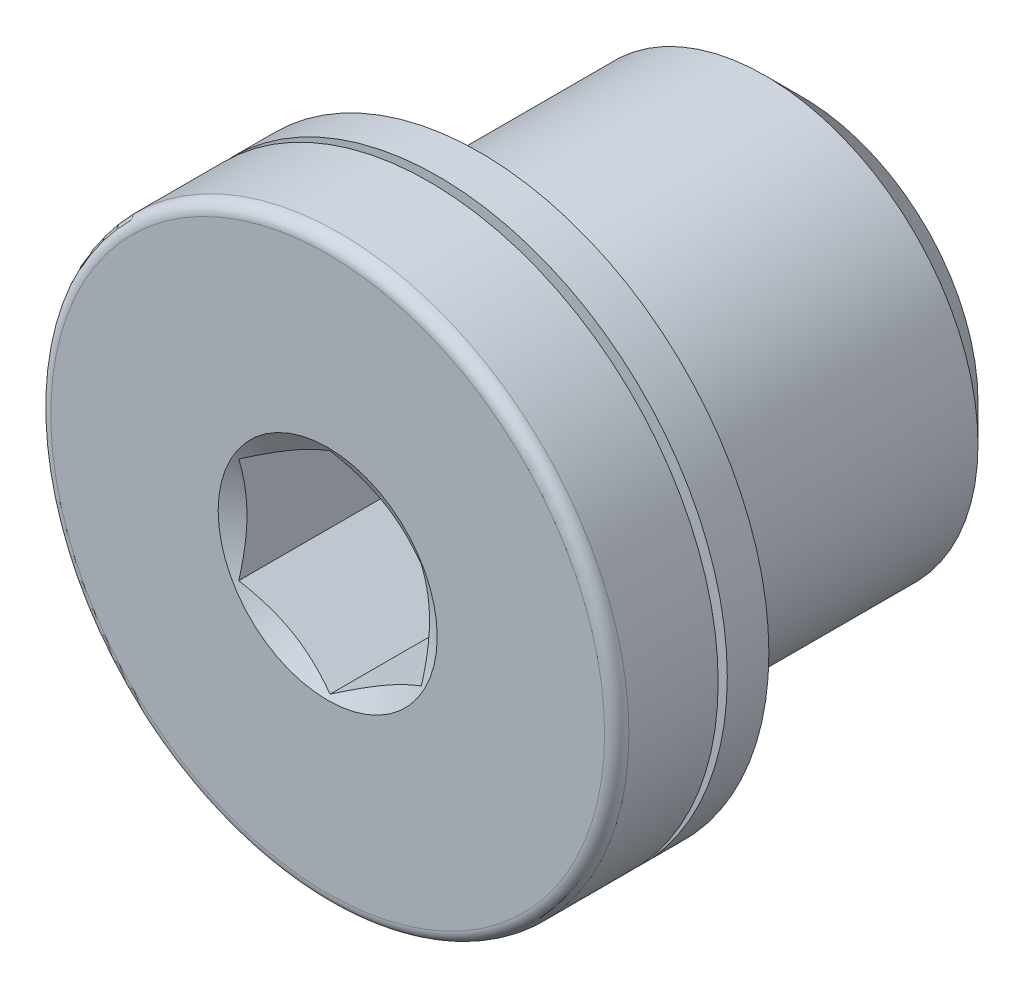
ISO-10303-21;
HEADER;
FILE_DESCRIPTION(('STEP AP214'),'2;1');
FILE_NAME('part.step','',(''),(''),'','','');
FILE_SCHEMA(('AUTOMOTIVE_DESIGN { 1 0 10303 214 1 1 1 1 }'));
ENDSEC;
DATA;
#1=APPLICATION_CONTEXT('core data for automotive mechanical design processes');
#2=APPLICATION_PROTOCOL_DEFINITION('international standard','automotive_design',2000,#1);
#3=PRODUCT_CONTEXT('',#1,'mechanical');
#4=PRODUCT('Part','Part','',(#3));
#5=PRODUCT_RELATED_PRODUCT_CATEGORY('part','',(#4));
#6=PRODUCT_DEFINITION_FORMATION('','',#4);
#7=PRODUCT_DEFINITION_CONTEXT('part definition',#1,'design');
#8=PRODUCT_DEFINITION('design','',#6,#7);
#9=PRODUCT_DEFINITION_SHAPE('','',#8);
#10=(LENGTH_UNIT() NAMED_UNIT(*) SI_UNIT(.MILLI.,.METRE.));
#11=(NAMED_UNIT(*) PLANE_ANGLE_UNIT() SI_UNIT($,.RADIAN.));
#12=(NAMED_UNIT(*) SI_UNIT($,.STERADIAN.) SOLID_ANGLE_UNIT());
#13=UNCERTAINTY_MEASURE_WITH_UNIT(LENGTH_MEASURE(1.E-05),#10,'distance_accuracy_value','');
#14=(GEOMETRIC_REPRESENTATION_CONTEXT(3) GLOBAL_UNCERTAINTY_ASSIGNED_CONTEXT((#13)) GLOBAL_UNIT_ASSIGNED_CONTEXT((#10,
#11,#12)) REPRESENTATION_CONTEXT('',''));
#15=CARTESIAN_POINT('',(0.,0.,0.));
#16=DIRECTION('',(0.,0.,1.));
#17=DIRECTION('',(1.,0.,0.));
#18=AXIS2_PLACEMENT_3D('',#15,#16,#17);
#19=CARTESIAN_POINT('',(0.,0.,2.5));
#20=DIRECTION('',(0.,0.,1.));
#21=DIRECTION('',(1.,0.,0.));
#22=AXIS2_PLACEMENT_3D('',#19,#20,#21);
#23=CONICAL_SURFACE('',#22,1.8,1.04719755119661);
#24=CARTESIAN_POINT('',(0.0002,-1.73216627762274,2.46083618879158));
#25=CARTESIAN_POINT('',(-0.065719291102548,-1.69410775715989,2.4388523720123));
#26=CARTESIAN_POINT('',(-0.132207589122236,-1.65572072040026,2.41885840492495));
#27=CARTESIAN_POINT('',(-0.266335660665071,-1.57828184218912,2.38395761642763));
#28=CARTESIAN_POINT('',(-0.333977818646887,-1.53922862406975,2.36906314356629));
#29=CARTESIAN_POINT('',(-0.468423777869844,-1.46160621332092,2.34587619655337));
#30=CARTESIAN_POINT('',(-0.535206884927249,-1.423048968484,2.33742942695494));
#31=CARTESIAN_POINT('',(-0.669087568389883,-1.34575291984756,2.32734309275498));
#32=CARTESIAN_POINT('',(-0.736184657704381,-1.30701439726999,2.32569517860101));
#33=CARTESIAN_POINT('',(-0.861574731829198,-1.23462040422032,2.32911113829623));
#34=CARTESIAN_POINT('',(-0.919886423219822,-1.20095413349904,2.3333362744671));
#35=CARTESIAN_POINT('',(-1.03612987953878,-1.13384094270175,2.34673129067579));
#36=CARTESIAN_POINT('',(-1.09406124196879,-1.10039425500827,2.35590575285897));
#37=CARTESIAN_POINT('',(-1.21054465133915,-1.03314252725216,2.37884269919811));
#38=CARTESIAN_POINT('',(-1.26908194454669,-0.999346005261155,2.39270247740456));
#39=CARTESIAN_POINT('',(-1.38528312338636,-0.93225722337792,2.42415929947977));
#40=CARTESIAN_POINT('',(-1.44294849940381,-0.898964103011323,2.44174894513273));
#41=CARTESIAN_POINT('',(-1.5002,-0.865909933730602,2.46083618879156));
#42=B_SPLINE_CURVE_WITH_KNOTS('',3,(#24,#25,#26,#27,#28,#29,#30,#31,#32,#33,#34,#35,#36,#37,#38,
#39,#40,#41),.UNSPECIFIED.,.F.,.F.,(4,2,2,2,2,2,2,2,4),(0.,0.237777822177386,0.476127422841923,
0.708577067230597,0.94074115925159,1.14294352835891,1.34533342091877,1.55221450553908,
1.75868901573749),.UNSPECIFIED.);
#43=CARTESIAN_POINT('',(0.,-1.7320508075689,2.46076951545869));
#44=VERTEX_POINT('',#43);
#45=CARTESIAN_POINT('',(-1.5,-0.86602540378444,2.46076951545867));
#46=VERTEX_POINT('',#45);
#47=EDGE_CURVE('E168',#44,#46,#42,.T.);
#48=ORIENTED_EDGE('',*,*,#47,.T.);
#49=CARTESIAN_POINT('',(-1.5,-2.25449487473002,3.02417894575131));
#50=CARTESIAN_POINT('',(-1.5,-2.18951895975955,2.99295556483411));
#51=CARTESIAN_POINT('',(-1.5,-2.12438599441687,2.96205331884631));
#52=CARTESIAN_POINT('',(-1.5,-1.99372174232584,2.90107322688863));
#53=CARTESIAN_POINT('',(-1.5,-1.9281903872708,2.87099552745922));
#54=CARTESIAN_POINT('',(-1.5,-1.7962718752327,2.81167969083687));
#55=CARTESIAN_POINT('',(-1.5,-1.72988194092756,2.78244770284));
#56=CARTESIAN_POINT('',(-1.5,-1.59654893466322,2.72528172903382));
#57=CARTESIAN_POINT('',(-1.5,-1.5296058914827,2.69734767618668));
#58=CARTESIAN_POINT('',(-1.5,-1.39324789918086,2.64239126721837));
#59=CARTESIAN_POINT('',(-1.5,-1.32381477939996,2.61541339766682));
#60=CARTESIAN_POINT('',(-1.5,-1.1841253512493,2.56368801336878));
#61=CARTESIAN_POINT('',(-1.5,-1.11386894081268,2.53894077854109));
#62=CARTESIAN_POINT('',(-1.5,-0.90197471266481,2.46908080541835));
#63=CARTESIAN_POINT('',(-1.5,-0.75882669728837,2.4281873391452));
#64=CARTESIAN_POINT('',(-1.5,-0.541397686192704,2.38067411172983));
#65=CARTESIAN_POINT('',(-1.5,-0.468631751225925,2.36715539507511));
#66=CARTESIAN_POINT('',(-1.5,-0.322271530861874,2.34561486969389));
#67=CARTESIAN_POINT('',(-1.5,-0.2486773048159,2.33759266963074));
#68=CARTESIAN_POINT('',(-1.5,-0.10195926078734,2.32778742645216));
#69=CARTESIAN_POINT('',(-1.5,-0.0288405464523352,2.32592996888511));
#70=CARTESIAN_POINT('',(-1.5,0.117289415015329,2.32841249396742));
#71=CARTESIAN_POINT('',(-1.5,0.190300655485831,2.33275284585121));
#72=CARTESIAN_POINT('',(-1.5,0.369900272499173,2.35067070029578));
#73=CARTESIAN_POINT('',(-1.5,0.476151491099886,2.36762944119825));
#74=CARTESIAN_POINT('',(-1.5,0.68660343856145,2.41150649751132));
#75=CARTESIAN_POINT('',(-1.5,0.790801557823266,2.43843672282148));
#76=CARTESIAN_POINT('',(-1.5,0.946649018941069,2.48450514131975));
#77=CARTESIAN_POINT('',(-1.5,0.999102742060011,2.50102307196098));
#78=CARTESIAN_POINT('',(-1.5,1.10346419973978,2.53560364411529));
#79=CARTESIAN_POINT('',(-1.5,1.15537225147017,2.55366532539763));
#80=CARTESIAN_POINT('',(-1.5,1.25871124885827,2.5910695388296));
#81=CARTESIAN_POINT('',(-1.5,1.31014227565007,2.61041184843574));
#82=CARTESIAN_POINT('',(-1.5,1.41259772302618,2.6501663798621));
#83=CARTESIAN_POINT('',(-1.5,1.46362207375394,2.67057878112024));
#84=CARTESIAN_POINT('',(-1.5,1.5947011629022,2.72434566321575));
#85=CARTESIAN_POINT('',(-1.5,1.67448504553484,2.75835978628998));
#86=CARTESIAN_POINT('',(-1.5,1.83332269964638,2.8280566764062));
#87=CARTESIAN_POINT('',(-1.5,1.91237641364752,2.86373957349331));
#88=CARTESIAN_POINT('',(-1.5,2.14868801817821,2.97269906752471));
#89=CARTESIAN_POINT('',(-1.5,2.30506851111714,3.04787469154103));
#90=CARTESIAN_POINT('',(-1.5,2.61648479474454,3.2014106800015));
#91=CARTESIAN_POINT('',(-1.5,2.77151863987043,3.27977494298172));
#92=CARTESIAN_POINT('',(-1.5,3.08051663764222,3.43853099709957));
#93=CARTESIAN_POINT('',(-1.5,3.2344809288262,3.51892251915847));
#94=CARTESIAN_POINT('',(-1.5,3.52698196603628,3.67334405726543));
#95=CARTESIAN_POINT('',(-1.5,3.66558594079719,3.74724717862088));
#96=CARTESIAN_POINT('',(-1.5,3.94234758145213,3.89589653993271));
#97=CARTESIAN_POINT('',(-1.5,4.08050522983664,3.97064281246165));
#98=CARTESIAN_POINT('',(-1.5,4.35611711975514,4.12057050503195));
#99=CARTESIAN_POINT('',(-1.5,4.49357225608424,4.19575028238427));
#100=CARTESIAN_POINT('',(-1.5,4.76820452191987,4.34659856800523));
#101=CARTESIAN_POINT('',(-1.5,4.90538166605457,4.42226704963179));
#102=CARTESIAN_POINT('',(-1.5,5.04245915933099,4.49811453885877));
#103=B_SPLINE_CURVE_WITH_KNOTS('',3,(#49,#50,#51,#52,#53,#54,#55,#56,#57,#58,#59,#60,#61,#62,
#63,#64,#65,#66,#67,#68,#69,#70,#71,#72,#73,#74,#75,#76,#77,#78,#79,#80,#81,#82,#83,#84,#85,#86,
#87,#88,#89,#90,#91,#92,#93,#94,#95,#96,#97,#98,#99,#100,#101,#102),.UNSPECIFIED.,.F.,.F.,(4,2,
2,2,2,2,2,2,2,2,2,2,2,2,2,2,2,2,2,2,2,2,2,2,2,2,4),(0.,0.21626857543461,0.432575340705332,
0.650185173255058,0.867783753821393,1.09121304981945,1.31467034468211,1.7603326968106,
1.98219855326605,2.20404861185029,2.42321079147534,2.64238602822897,2.96451249577065,
3.28702495748385,3.45198572823616,3.61684462797875,3.78167495388356,3.94653300826296,
4.20670103184536,4.46688936383544,4.98735671722525,5.50848074777699,6.02953596970779,
6.50075937148774,6.97200104031917,7.44201403916588,7.91200162762675),.UNSPECIFIED.);
#104=CARTESIAN_POINT('',(-1.5,0.86602540378444,2.46076951545867));
#105=VERTEX_POINT('',#104);
#106=EDGE_CURVE('E11',#46,#105,#103,.T.);
#107=ORIENTED_EDGE('',*,*,#106,.T.);
#108=CARTESIAN_POINT('',(-1.5002,0.865909933730602,2.46083618879156));
#109=CARTESIAN_POINT('',(-1.43428070889745,0.903968454193448,2.43885237201229));
#110=CARTESIAN_POINT('',(-1.36779241087777,0.942355490953075,2.41885840492494));
#111=CARTESIAN_POINT('',(-1.23366433933493,1.01979436916422,2.38395761642762));
#112=CARTESIAN_POINT('',(-1.16602218135312,1.05884758728359,2.36906314356628));
#113=CARTESIAN_POINT('',(-1.03157622213016,1.13646999803242,2.34587619655336));
#114=CARTESIAN_POINT('',(-0.964793115072756,1.17502724286933,2.33742942695493));
#115=CARTESIAN_POINT('',(-0.830912431610124,1.25232329150578,2.32734309275497));
#116=CARTESIAN_POINT('',(-0.763815342295627,1.29106181408334,2.32569517860101));
#117=CARTESIAN_POINT('',(-0.63842526817081,1.36345580713302,2.32911113829623));
#118=CARTESIAN_POINT('',(-0.580113576780185,1.3971220778543,2.3333362744671));
#119=CARTESIAN_POINT('',(-0.463870120461221,1.46423526865158,2.3467312906758));
#120=CARTESIAN_POINT('',(-0.405938758031217,1.49768195634507,2.35590575285897));
#121=CARTESIAN_POINT('',(-0.28945534866085,1.56493368410118,2.37884269919812));
#122=CARTESIAN_POINT('',(-0.23091805545331,1.59873020609218,2.39270247740457));
#123=CARTESIAN_POINT('',(-0.114716876613641,1.66581898797542,2.42415929947978));
#124=CARTESIAN_POINT('',(-0.0570515005961896,1.69911210834202,2.44174894513274));
#125=CARTESIAN_POINT('',(0.000200000000000186,1.73216627762274,2.46083618879158));
#126=B_SPLINE_CURVE_WITH_KNOTS('',3,(#108,#109,#110,#111,#112,#113,#114,#115,#116,#117,#118,
#119,#120,#121,#122,#123,#124,#125),.UNSPECIFIED.,.F.,.F.,(4,2,2,2,2,2,2,2,4),(0.,
0.237777822177383,0.476127422841917,0.708577067230588,0.940741159251578,1.14294352835891,
1.34533342091876,1.55221450553908,1.75868901573749),.UNSPECIFIED.);
#127=CARTESIAN_POINT('',(0.,1.7320508075689,2.46076951545869));
#128=VERTEX_POINT('',#127);
#129=EDGE_CURVE('E48',#105,#128,#126,.T.);
#130=ORIENTED_EDGE('',*,*,#129,.T.);
#131=CARTESIAN_POINT('',(-0.0002,1.73216627762274,2.46083618879158));
#132=CARTESIAN_POINT('',(0.065719291102548,1.69410775715989,2.4388523720123));
#133=CARTESIAN_POINT('',(0.132207589122236,1.65572072040026,2.41885840492495));
#134=CARTESIAN_POINT('',(0.266335660665071,1.57828184218912,2.38395761642763));
#135=CARTESIAN_POINT('',(0.333977818646887,1.53922862406975,2.36906314356629));
#136=CARTESIAN_POINT('',(0.468423777869844,1.46160621332092,2.34587619655337));
#137=CARTESIAN_POINT('',(0.535206884927249,1.423048968484,2.33742942695494));
#138=CARTESIAN_POINT('',(0.669087568389883,1.34575291984756,2.32734309275498));
#139=CARTESIAN_POINT('',(0.736184657704381,1.30701439726999,2.32569517860101));
#140=CARTESIAN_POINT('',(0.861574731829198,1.23462040422032,2.32911113829623));
#141=CARTESIAN_POINT('',(0.919886423219822,1.20095413349904,2.3333362744671));
#142=CARTESIAN_POINT('',(1.03612987953878,1.13384094270175,2.34673129067579));
#143=CARTESIAN_POINT('',(1.09406124196879,1.10039425500827,2.35590575285897));
#144=CARTESIAN_POINT('',(1.21054465133915,1.03314252725216,2.37884269919811));
#145=CARTESIAN_POINT('',(1.26908194454669,0.999346005261155,2.39270247740456));
#146=CARTESIAN_POINT('',(1.38528312338636,0.93225722337792,2.42415929947977));
#147=CARTESIAN_POINT('',(1.44294849940381,0.898964103011323,2.44174894513273));
#148=CARTESIAN_POINT('',(1.5002,0.865909933730602,2.46083618879156));
#149=B_SPLINE_CURVE_WITH_KNOTS('',3,(#131,#132,#133,#134,#135,#136,#137,#138,#139,#140,#141,
#142,#143,#144,#145,#146,#147,#148),.UNSPECIFIED.,.F.,.F.,(4,2,2,2,2,2,2,2,4),(0.,
0.237777822177386,0.476127422841923,0.708577067230597,0.94074115925159,1.14294352835891,
1.34533342091877,1.55221450553908,1.75868901573749),.UNSPECIFIED.);
#150=CARTESIAN_POINT('',(1.5,0.86602540378444,2.46076951545867));
#151=VERTEX_POINT('',#150);
#152=EDGE_CURVE('E276',#128,#151,#149,.T.);
#153=ORIENTED_EDGE('',*,*,#152,.T.);
#154=CARTESIAN_POINT('',(1.5,-2.25449487473002,3.02417894575131));
#155=CARTESIAN_POINT('',(1.5,-2.18951895975955,2.99295556483411));
#156=CARTESIAN_POINT('',(1.5,-2.12438599441687,2.96205331884631));
#157=CARTESIAN_POINT('',(1.5,-1.99372174232584,2.90107322688863));
#158=CARTESIAN_POINT('',(1.5,-1.9281903872708,2.87099552745922));
#159=CARTESIAN_POINT('',(1.5,-1.7962718752327,2.81167969083687));
#160=CARTESIAN_POINT('',(1.5,-1.72988194092756,2.78244770284));
#161=CARTESIAN_POINT('',(1.5,-1.59654893466322,2.72528172903382));
#162=CARTESIAN_POINT('',(1.5,-1.5296058914827,2.69734767618668));
#163=CARTESIAN_POINT('',(1.5,-1.39324789918086,2.64239126721837));
#164=CARTESIAN_POINT('',(1.5,-1.32381477939996,2.61541339766682));
#165=CARTESIAN_POINT('',(1.5,-1.1841253512493,2.56368801336878));
#166=CARTESIAN_POINT('',(1.5,-1.11386894081268,2.53894077854109));
#167=CARTESIAN_POINT('',(1.5,-0.90197471266481,2.46908080541835));
#168=CARTESIAN_POINT('',(1.5,-0.75882669728837,2.4281873391452));
#169=CARTESIAN_POINT('',(1.5,-0.541397686192704,2.38067411172983));
#170=CARTESIAN_POINT('',(1.5,-0.468631751225925,2.36715539507511));
#171=CARTESIAN_POINT('',(1.5,-0.322271530861874,2.34561486969389));
#172=CARTESIAN_POINT('',(1.5,-0.2486773048159,2.33759266963074));
#173=CARTESIAN_POINT('',(1.5,-0.10195926078734,2.32778742645216));
#174=CARTESIAN_POINT('',(1.5,-0.0288405464523352,2.32592996888511));
#175=CARTESIAN_POINT('',(1.5,0.117289415015329,2.32841249396742));
#176=CARTESIAN_POINT('',(1.5,0.190300655485831,2.33275284585121));
#177=CARTESIAN_POINT('',(1.5,0.369900272499173,2.35067070029578));
#178=CARTESIAN_POINT('',(1.5,0.476151491099886,2.36762944119825));
#179=CARTESIAN_POINT('',(1.5,0.68660343856145,2.41150649751132));
#180=CARTESIAN_POINT('',(1.5,0.790801557823266,2.43843672282148));
#181=CARTESIAN_POINT('',(1.5,0.946649018941069,2.48450514131975));
#182=CARTESIAN_POINT('',(1.5,0.999102742060011,2.50102307196098));
#183=CARTESIAN_POINT('',(1.5,1.10346419973978,2.53560364411529));
#184=CARTESIAN_POINT('',(1.5,1.15537225147017,2.55366532539763));
#185=CARTESIAN_POINT('',(1.5,1.25871124885827,2.5910695388296));
#186=CARTESIAN_POINT('',(1.5,1.31014227565007,2.61041184843574));
#187=CARTESIAN_POINT('',(1.5,1.41259772302618,2.6501663798621));
#188=CARTESIAN_POINT('',(1.5,1.46362207375394,2.67057878112024));
#189=CARTESIAN_POINT('',(1.5,1.5947011629022,2.72434566321575));
#190=CARTESIAN_POINT('',(1.5,1.67448504553484,2.75835978628998));
#191=CARTESIAN_POINT('',(1.5,1.83332269964638,2.8280566764062));
#192=CARTESIAN_POINT('',(1.5,1.91237641364752,2.86373957349331));
#193=CARTESIAN_POINT('',(1.5,2.14868801817821,2.97269906752471));
#194=CARTESIAN_POINT('',(1.5,2.30506851111714,3.04787469154103));
#195=CARTESIAN_POINT('',(1.5,2.61648479474454,3.2014106800015));
#196=CARTESIAN_POINT('',(1.5,2.77151863987043,3.27977494298172));
#197=CARTESIAN_POINT('',(1.5,3.08051663764222,3.43853099709957));
#198=CARTESIAN_POINT('',(1.5,3.2344809288262,3.51892251915847));
#199=CARTESIAN_POINT('',(1.5,3.52698196603628,3.67334405726543));
#200=CARTESIAN_POINT('',(1.5,3.66558594079719,3.74724717862088));
#201=CARTESIAN_POINT('',(1.5,3.94234758145213,3.89589653993271));
#202=CARTESIAN_POINT('',(1.5,4.08050522983664,3.97064281246165));
#203=CARTESIAN_POINT('',(1.5,4.35611711975514,4.12057050503195));
#204=CARTESIAN_POINT('',(1.5,4.49357225608424,4.19575028238427));
#205=CARTESIAN_POINT('',(1.5,4.76820452191987,4.34659856800523));
#206=CARTESIAN_POINT('',(1.5,4.90538166605457,4.42226704963179));
#207=CARTESIAN_POINT('',(1.5,5.04245915933099,4.49811453885877));
#208=B_SPLINE_CURVE_WITH_KNOTS('',3,(#154,#155,#156,#157,#158,#159,#160,#161,#162,#163,#164,
#165,#166,#167,#168,#169,#170,#171,#172,#173,#174,#175,#176,#177,#178,#179,#180,#181,#182,#183,
#184,#185,#186,#187,#188,#189,#190,#191,#192,#193,#194,#195,#196,#197,#198,#199,#200,#201,#202,
#203,#204,#205,#206,#207),.UNSPECIFIED.,.F.,.F.,(4,2,2,2,2,2,2,2,2,2,2,2,2,2,2,2,2,2,2,2,2,2,2,
2,2,2,4),(0.,0.21626857543461,0.432575340705332,0.650185173255058,0.867783753821393,
1.09121304981945,1.31467034468211,1.7603326968106,1.98219855326605,2.20404861185029,
2.42321079147534,2.64238602822897,2.96451249577065,3.28702495748385,3.45198572823616,
3.61684462797875,3.78167495388356,3.94653300826296,4.20670103184536,4.46688936383544,
4.98735671722525,5.50848074777699,6.02953596970779,6.50075937148774,6.97200104031917,
7.44201403916588,7.91200162762675),.UNSPECIFIED.);
#209=CARTESIAN_POINT('',(1.5,-0.86602540378444,2.46076951545867));
#210=VERTEX_POINT('',#209);
#211=EDGE_CURVE('E272',#151,#210,#208,.F.);
#212=ORIENTED_EDGE('',*,*,#211,.T.);
#213=CARTESIAN_POINT('',(1.5002,-0.865909933730602,2.46083618879156));
#214=CARTESIAN_POINT('',(1.43428070889745,-0.903968454193448,2.43885237201229));
#215=CARTESIAN_POINT('',(1.36779241087777,-0.942355490953075,2.41885840492494));
#216=CARTESIAN_POINT('',(1.23366433933493,-1.01979436916422,2.38395761642762));
#217=CARTESIAN_POINT('',(1.16602218135312,-1.05884758728359,2.36906314356628));
#218=CARTESIAN_POINT('',(1.03157622213016,-1.13646999803242,2.34587619655336));
#219=CARTESIAN_POINT('',(0.964793115072756,-1.17502724286933,2.33742942695493));
#220=CARTESIAN_POINT('',(0.830912431610124,-1.25232329150578,2.32734309275497));
#221=CARTESIAN_POINT('',(0.763815342295627,-1.29106181408334,2.32569517860101));
#222=CARTESIAN_POINT('',(0.63842526817081,-1.36345580713302,2.32911113829623));
#223=CARTESIAN_POINT('',(0.580113576780185,-1.3971220778543,2.3333362744671));
#224=CARTESIAN_POINT('',(0.463870120461221,-1.46423526865158,2.3467312906758));
#225=CARTESIAN_POINT('',(0.405938758031217,-1.49768195634507,2.35590575285897));
#226=CARTESIAN_POINT('',(0.28945534866085,-1.56493368410118,2.37884269919812));
#227=CARTESIAN_POINT('',(0.23091805545331,-1.59873020609218,2.39270247740457));
#228=CARTESIAN_POINT('',(0.114716876613641,-1.66581898797542,2.42415929947978));
#229=CARTESIAN_POINT('',(0.0570515005961896,-1.69911210834202,2.44174894513274));
#230=CARTESIAN_POINT('',(-0.000200000000000186,-1.73216627762274,2.46083618879158));
#231=B_SPLINE_CURVE_WITH_KNOTS('',3,(#213,#214,#215,#216,#217,#218,#219,#220,#221,#222,#223,
#224,#225,#226,#227,#228,#229,#230),.UNSPECIFIED.,.F.,.F.,(4,2,2,2,2,2,2,2,4),(0.,
0.237777822177383,0.476127422841917,0.708577067230588,0.940741159251578,1.14294352835891,
1.34533342091876,1.55221450553908,1.75868901573749),.UNSPECIFIED.);
#232=EDGE_CURVE('E174',#210,#44,#231,.T.);
#233=ORIENTED_EDGE('',*,*,#232,.T.);
#234=EDGE_LOOP('',(#48,#107,#130,#153,#212,#233));
#235=FACE_BOUND('',#234,.T.);
#236=CARTESIAN_POINT('',(0.,0.,2.5));
#237=DIRECTION('',(0.,0.,1.));
#238=DIRECTION('',(1.,0.,0.));
#239=AXIS2_PLACEMENT_3D('',#236,#237,#238);
#240=CIRCLE('',#239,1.8);
#241=CARTESIAN_POINT('',(1.8,0.,2.5));
#242=VERTEX_POINT('',#241);
#243=EDGE_CURVE('E165',#242,#242,#240,.T.);
#244=ORIENTED_EDGE('',*,*,#243,.T.);
#245=EDGE_LOOP('',(#244));
#246=FACE_BOUND('',#245,.T.);
#247=ADVANCED_FACE('F36',(#235,#246),#23,.F.);
#248=CARTESIAN_POINT('',(0.,1.8,2.5));
#249=DIRECTION('',(0.,0.,-1.));
#250=DIRECTION('',(-1.,0.,0.));
#251=AXIS2_PLACEMENT_3D('',#248,#249,#250);
#252=PLANE('',#251);
#253=ORIENTED_EDGE('',*,*,#243,.F.);
#254=EDGE_LOOP('',(#253));
#255=FACE_BOUND('',#254,.T.);
#256=CARTESIAN_POINT('',(0.,0.,2.5));
#257=DIRECTION('',(0.,0.,1.));
#258=DIRECTION('',(1.,0.,0.));
#259=AXIS2_PLACEMENT_3D('',#256,#257,#258);
#260=CIRCLE('',#259,4.55);
#261=CARTESIAN_POINT('',(4.55,0.,2.5));
#262=VERTEX_POINT('',#261);
#263=EDGE_CURVE('E162',#262,#262,#260,.T.);
#264=ORIENTED_EDGE('',*,*,#263,.T.);
#265=EDGE_LOOP('',(#264));
#266=FACE_BOUND('',#265,.T.);
#267=ADVANCED_FACE('F231',(#255,#266),#252,.F.);
#268=CARTESIAN_POINT('',(0.,0.,2.29999999999997));
#269=DIRECTION('',(0.,0.,1.));
#270=DIRECTION('',(1.,0.,0.));
#271=AXIS2_PLACEMENT_3D('',#268,#269,#270);
#272=TOROIDAL_SURFACE('',#271,4.54999999999997,0.200000000000032);
#273=ORIENTED_EDGE('',*,*,#263,.F.);
#274=EDGE_LOOP('',(#273));
#275=FACE_BOUND('',#274,.T.);
#276=CARTESIAN_POINT('',(0.,0.,2.3));
#277=DIRECTION('',(0.,0.,1.));
#278=DIRECTION('',(1.,0.,0.));
#279=AXIS2_PLACEMENT_3D('',#276,#277,#278);
#280=CIRCLE('',#279,4.75);
#281=CARTESIAN_POINT('',(4.75,0.,2.3));
#282=VERTEX_POINT('',#281);
#283=EDGE_CURVE('E159',#282,#282,#280,.T.);
#284=ORIENTED_EDGE('',*,*,#283,.T.);
#285=EDGE_LOOP('',(#284));
#286=FACE_BOUND('',#285,.T.);
#287=ADVANCED_FACE('F228',(#275,#286),#272,.T.);
#288=CARTESIAN_POINT('',(0.,0.,-5.3));
#289=DIRECTION('',(0.,0.,1.));
#290=DIRECTION('',(1.,0.,0.));
#291=AXIS2_PLACEMENT_3D('',#288,#289,#290);
#292=CYLINDRICAL_SURFACE('',#291,4.75);
#293=ORIENTED_EDGE('',*,*,#283,.F.);
#294=EDGE_LOOP('',(#293));
#295=FACE_BOUND('',#294,.T.);
#296=CARTESIAN_POINT('',(0.,0.,0.83333333333333));
#297=DIRECTION('',(0.,0.,1.));
#298=DIRECTION('',(1.,0.,0.));
#299=AXIS2_PLACEMENT_3D('',#296,#297,#298);
#300=CIRCLE('',#299,4.75);
#301=CARTESIAN_POINT('',(4.75,0.,0.83333333333333));
#302=VERTEX_POINT('',#301);
#303=EDGE_CURVE('E156',#302,#302,#300,.T.);
#304=ORIENTED_EDGE('',*,*,#303,.T.);
#305=EDGE_LOOP('',(#304));
#306=FACE_BOUND('',#305,.T.);
#307=ADVANCED_FACE('F224',(#295,#306),#292,.T.);
#308=CARTESIAN_POINT('',(0.,4.75,0.83333333333333));
#309=DIRECTION('',(0.,0.,1.));
#310=DIRECTION('',(1.,0.,0.));
#311=AXIS2_PLACEMENT_3D('',#308,#309,#310);
#312=PLANE('',#311);
#313=ORIENTED_EDGE('',*,*,#303,.F.);
#314=EDGE_LOOP('',(#313));
#315=FACE_BOUND('',#314,.T.);
#316=CARTESIAN_POINT('',(0.,0.,0.83333333333333));
#317=DIRECTION('',(0.,0.,1.));
#318=DIRECTION('',(1.,0.,0.));
#319=AXIS2_PLACEMENT_3D('',#316,#317,#318);
#320=CIRCLE('',#319,4.275);
#321=CARTESIAN_POINT('',(4.275,0.,0.83333333333333));
#322=VERTEX_POINT('',#321);
#323=EDGE_CURVE('E153',#322,#322,#320,.T.);
#324=ORIENTED_EDGE('',*,*,#323,.T.);
#325=EDGE_LOOP('',(#324));
#326=FACE_BOUND('',#325,.T.);
#327=ADVANCED_FACE('F220',(#315,#326),#312,.F.);
#328=CARTESIAN_POINT('',(0.,0.,-5.3));
#329=DIRECTION('',(0.,0.,1.));
#330=DIRECTION('',(1.,0.,0.));
#331=AXIS2_PLACEMENT_3D('',#328,#329,#330);
#332=CYLINDRICAL_SURFACE('',#331,4.275);
#333=ORIENTED_EDGE('',*,*,#323,.F.);
#334=EDGE_LOOP('',(#333));
#335=FACE_BOUND('',#334,.T.);
#336=CARTESIAN_POINT('',(0.,0.,0.68333333333333));
#337=DIRECTION('',(0.,0.,1.));
#338=DIRECTION('',(1.,0.,0.));
#339=AXIS2_PLACEMENT_3D('',#336,#337,#338);
#340=CIRCLE('',#339,4.275);
#341=CARTESIAN_POINT('',(4.275,0.,0.68333333333333));
#342=VERTEX_POINT('',#341);
#343=EDGE_CURVE('E150',#342,#342,#340,.T.);
#344=ORIENTED_EDGE('',*,*,#343,.T.);
#345=EDGE_LOOP('',(#344));
#346=FACE_BOUND('',#345,.T.);
#347=ADVANCED_FACE('F216',(#335,#346),#332,.T.);
#348=CARTESIAN_POINT('',(0.,4.275,0.68333333333333));
#349=DIRECTION('',(0.,0.,-1.));
#350=DIRECTION('',(-1.,0.,0.));
#351=AXIS2_PLACEMENT_3D('',#348,#349,#350);
#352=PLANE('',#351);
#353=ORIENTED_EDGE('',*,*,#343,.F.);
#354=EDGE_LOOP('',(#353));
#355=FACE_BOUND('',#354,.T.);
#356=CARTESIAN_POINT('',(0.,0.,0.68333333333333));
#357=DIRECTION('',(0.,0.,1.));
#358=DIRECTION('',(1.,0.,0.));
#359=AXIS2_PLACEMENT_3D('',#356,#357,#358);
#360=CIRCLE('',#359,4.75);
#361=CARTESIAN_POINT('',(4.75,0.,0.68333333333333));
#362=VERTEX_POINT('',#361);
#363=EDGE_CURVE('E147',#362,#362,#360,.T.);
#364=ORIENTED_EDGE('',*,*,#363,.T.);
#365=EDGE_LOOP('',(#364));
#366=FACE_BOUND('',#365,.T.);
#367=ADVANCED_FACE('F212',(#355,#366),#352,.F.);
#368=CARTESIAN_POINT('',(0.,0.,-5.3));
#369=DIRECTION('',(0.,0.,1.));
#370=DIRECTION('',(1.,0.,0.));
#371=AXIS2_PLACEMENT_3D('',#368,#369,#370);
#372=CYLINDRICAL_SURFACE('',#371,4.75);
#373=ORIENTED_EDGE('',*,*,#363,.F.);
#374=EDGE_LOOP('',(#373));
#375=FACE_BOUND('',#374,.T.);
#376=CARTESIAN_POINT('',(0.,0.,0.));
#377=DIRECTION('',(0.,0.,1.));
#378=DIRECTION('',(1.,0.,0.));
#379=AXIS2_PLACEMENT_3D('',#376,#377,#378);
#380=CIRCLE('',#379,4.75);
#381=CARTESIAN_POINT('',(4.75,0.,0.));
#382=VERTEX_POINT('',#381);
#383=EDGE_CURVE('E144',#382,#382,#380,.T.);
#384=ORIENTED_EDGE('',*,*,#383,.T.);
#385=EDGE_LOOP('',(#384));
#386=FACE_BOUND('',#385,.T.);
#387=ADVANCED_FACE('F208',(#375,#386),#372,.T.);
#388=CARTESIAN_POINT('',(0.,4.75,0.));
#389=DIRECTION('',(0.,0.,1.));
#390=DIRECTION('',(1.,0.,0.));
#391=AXIS2_PLACEMENT_3D('',#388,#389,#390);
#392=PLANE('',#391);
#393=ORIENTED_EDGE('',*,*,#383,.F.);
#394=EDGE_LOOP('',(#393));
#395=FACE_BOUND('',#394,.T.);
#396=CARTESIAN_POINT('',(0.,0.,0.));
#397=DIRECTION('',(0.,0.,1.));
#398=DIRECTION('',(1.,0.,0.));
#399=AXIS2_PLACEMENT_3D('',#396,#397,#398);
#400=CIRCLE('',#399,2.8865);
#401=CARTESIAN_POINT('',(2.8865,0.,0.));
#402=VERTEX_POINT('',#401);
#403=EDGE_CURVE('E141',#402,#402,#400,.T.);
#404=ORIENTED_EDGE('',*,*,#403,.T.);
#405=EDGE_LOOP('',(#404));
#406=FACE_BOUND('',#405,.T.);
#407=ADVANCED_FACE('F204',(#395,#406),#392,.F.);
#408=CARTESIAN_POINT('',(0.,0.,-0.6135));
#409=DIRECTION('',(0.,0.,-1.));
#410=DIRECTION('',(-1.,0.,0.));
#411=AXIS2_PLACEMENT_3D('',#408,#409,#410);
#412=CONICAL_SURFACE('',#411,3.5,0.785398163397448);
#413=ORIENTED_EDGE('',*,*,#403,.F.);
#414=EDGE_LOOP('',(#413));
#415=FACE_BOUND('',#414,.T.);
#416=CARTESIAN_POINT('',(0.,0.,-0.6135));
#417=DIRECTION('',(0.,0.,1.));
#418=DIRECTION('',(1.,0.,0.));
#419=AXIS2_PLACEMENT_3D('',#416,#417,#418);
#420=CIRCLE('',#419,3.5);
#421=CARTESIAN_POINT('',(3.5,0.,-0.6135));
#422=VERTEX_POINT('',#421);
#423=EDGE_CURVE('E138',#422,#422,#420,.T.);
#424=ORIENTED_EDGE('',*,*,#423,.T.);
#425=EDGE_LOOP('',(#424));
#426=FACE_BOUND('',#425,.T.);
#427=ADVANCED_FACE('F200',(#415,#426),#412,.T.);
#428=CARTESIAN_POINT('',(0.,0.,-5.3));
#429=DIRECTION('',(0.,0.,1.));
#430=DIRECTION('',(1.,0.,0.));
#431=AXIS2_PLACEMENT_3D('',#428,#429,#430);
#432=CYLINDRICAL_SURFACE('',#431,3.5);
#433=ORIENTED_EDGE('',*,*,#423,.F.);
#434=EDGE_LOOP('',(#433));
#435=FACE_BOUND('',#434,.T.);
#436=CARTESIAN_POINT('',(0.,0.,-4.6865));
#437=DIRECTION('',(0.,0.,1.));
#438=DIRECTION('',(1.,0.,0.));
#439=AXIS2_PLACEMENT_3D('',#436,#437,#438);
#440=CIRCLE('',#439,3.5);
#441=CARTESIAN_POINT('',(3.5,0.,-4.6865));
#442=VERTEX_POINT('',#441);
#443=EDGE_CURVE('E135',#442,#442,#440,.T.);
#444=ORIENTED_EDGE('',*,*,#443,.T.);
#445=EDGE_LOOP('',(#444));
#446=FACE_BOUND('',#445,.T.);
#447=ADVANCED_FACE('F196',(#435,#446),#432,.T.);
#448=CARTESIAN_POINT('',(0.,0.,-5.3));
#449=DIRECTION('',(0.,0.,1.));
#450=DIRECTION('',(1.,0.,0.));
#451=AXIS2_PLACEMENT_3D('',#448,#449,#450);
#452=CONICAL_SURFACE('',#451,2.8865,0.785398163397448);
#453=ORIENTED_EDGE('',*,*,#443,.F.);
#454=EDGE_LOOP('',(#453));
#455=FACE_BOUND('',#454,.T.);
#456=CARTESIAN_POINT('',(0.,0.,-5.3));
#457=DIRECTION('',(0.,0.,1.));
#458=DIRECTION('',(1.,0.,0.));
#459=AXIS2_PLACEMENT_3D('',#456,#457,#458);
#460=CIRCLE('',#459,2.8865);
#461=CARTESIAN_POINT('',(2.8865,0.,-5.3));
#462=VERTEX_POINT('',#461);
#463=EDGE_CURVE('E123',#462,#462,#460,.T.);
#464=ORIENTED_EDGE('',*,*,#463,.T.);
#465=EDGE_LOOP('',(#464));
#466=FACE_BOUND('',#465,.T.);
#467=ADVANCED_FACE('F192',(#455,#466),#452,.T.);
#468=CARTESIAN_POINT('',(0.,2.8865,-5.3));
#469=DIRECTION('',(0.,0.,1.));
#470=DIRECTION('',(1.,0.,0.));
#471=AXIS2_PLACEMENT_3D('',#468,#469,#470);
#472=PLANE('',#471);
#473=ORIENTED_EDGE('',*,*,#463,.F.);
#474=EDGE_LOOP('',(#473));
#475=FACE_BOUND('',#474,.T.);
#476=ADVANCED_FACE('F189',(#475),#472,.F.);
#477=CARTESIAN_POINT('',(-1.5,0.86602540378444,0.));
#478=DIRECTION('',(-1.,0.,0.));
#479=DIRECTION('',(0.,0.,1.));
#480=AXIS2_PLACEMENT_3D('',#477,#478,#479);
#481=PLANE('',#480);
#482=DIRECTION('',(0.,0.,1.));
#483=VECTOR('',#482,1.);
#484=CARTESIAN_POINT('',(-1.5,-0.86602540378444,0.));
#485=LINE('',#484,#483);
#486=CARTESIAN_POINT('',(-1.5,-0.86602540378444,0.));
#487=VERTEX_POINT('',#486);
#488=EDGE_CURVE('E55',#487,#46,#485,.T.);
#489=ORIENTED_EDGE('',*,*,#488,.F.);
#490=DIRECTION('',(0.,-1.,0.));
#491=VECTOR('',#490,1.);
#492=CARTESIAN_POINT('',(-1.5,0.86602540378444,0.));
#493=LINE('',#492,#491);
#494=CARTESIAN_POINT('',(-1.5,0.86602540378444,0.));
#495=VERTEX_POINT('',#494);
#496=EDGE_CURVE('E94',#495,#487,#493,.T.);
#497=ORIENTED_EDGE('',*,*,#496,.F.);
#498=DIRECTION('',(0.,0.,1.));
#499=VECTOR('',#498,1.);
#500=CARTESIAN_POINT('',(-1.5,0.86602540378444,0.));
#501=LINE('',#500,#499);
#502=EDGE_CURVE('E121',#495,#105,#501,.T.);
#503=ORIENTED_EDGE('',*,*,#502,.T.);
#504=ORIENTED_EDGE('',*,*,#106,.F.);
#505=EDGE_LOOP('',(#489,#497,#503,#504));
#506=FACE_BOUND('',#505,.T.);
#507=ADVANCED_FACE('F92',(#506),#481,.F.);
#508=CARTESIAN_POINT('',(0.,1.7320508075689,0.));
#509=DIRECTION('',(-0.500000000000009,0.866025403784433,0.));
#510=DIRECTION('',(-0.866025403784433,-0.500000000000009,0.));
#511=AXIS2_PLACEMENT_3D('',#508,#509,#510);
#512=PLANE('',#511);
#513=ORIENTED_EDGE('',*,*,#502,.F.);
#514=DIRECTION('',(-0.866025403784433,-0.500000000000009,0.));
#515=VECTOR('',#514,1.);
#516=CARTESIAN_POINT('',(0.,1.7320508075689,0.));
#517=LINE('',#516,#515);
#518=CARTESIAN_POINT('',(0.,1.7320508075689,0.));
#519=VERTEX_POINT('',#518);
#520=EDGE_CURVE('E98',#519,#495,#517,.T.);
#521=ORIENTED_EDGE('',*,*,#520,.F.);
#522=DIRECTION('',(0.,0.,1.));
#523=VECTOR('',#522,1.);
#524=CARTESIAN_POINT('',(0.,1.7320508075689,0.));
#525=LINE('',#524,#523);
#526=EDGE_CURVE('E124',#519,#128,#525,.T.);
#527=ORIENTED_EDGE('',*,*,#526,.T.);
#528=ORIENTED_EDGE('',*,*,#129,.F.);
#529=EDGE_LOOP('',(#513,#521,#527,#528));
#530=FACE_BOUND('',#529,.T.);
#531=ADVANCED_FACE('F188',(#530),#512,.F.);
#532=CARTESIAN_POINT('',(1.5,0.86602540378444,0.));
#533=DIRECTION('',(0.500000000000009,0.866025403784433,0.));
#534=DIRECTION('',(-0.866025403784433,0.500000000000009,0.));
#535=AXIS2_PLACEMENT_3D('',#532,#533,#534);
#536=PLANE('',#535);
#537=ORIENTED_EDGE('',*,*,#526,.F.);
#538=DIRECTION('',(-0.866025403784433,0.500000000000009,0.));
#539=VECTOR('',#538,1.);
#540=CARTESIAN_POINT('',(1.5,0.86602540378444,0.));
#541=LINE('',#540,#539);
#542=CARTESIAN_POINT('',(1.5,0.86602540378444,0.));
#543=VERTEX_POINT('',#542);
#544=EDGE_CURVE('E118',#543,#519,#541,.T.);
#545=ORIENTED_EDGE('',*,*,#544,.F.);
#546=DIRECTION('',(0.,0.,1.));
#547=VECTOR('',#546,1.);
#548=CARTESIAN_POINT('',(1.5,0.86602540378444,0.));
#549=LINE('',#548,#547);
#550=EDGE_CURVE('E126',#543,#151,#549,.T.);
#551=ORIENTED_EDGE('',*,*,#550,.T.);
#552=ORIENTED_EDGE('',*,*,#152,.F.);
#553=EDGE_LOOP('',(#537,#545,#551,#552));
#554=FACE_BOUND('',#553,.T.);
#555=ADVANCED_FACE('F275',(#554),#536,.F.);
#556=CARTESIAN_POINT('',(1.5,-0.86602540378444,0.));
#557=DIRECTION('',(1.,0.,0.));
#558=DIRECTION('',(0.,0.,-1.));
#559=AXIS2_PLACEMENT_3D('',#556,#557,#558);
#560=PLANE('',#559);
#561=ORIENTED_EDGE('',*,*,#550,.F.);
#562=DIRECTION('',(0.,1.,0.));
#563=VECTOR('',#562,1.);
#564=CARTESIAN_POINT('',(1.5,-0.86602540378444,0.));
#565=LINE('',#564,#563);
#566=CARTESIAN_POINT('',(1.5,-0.86602540378444,0.));
#567=VERTEX_POINT('',#566);
#568=EDGE_CURVE('E115',#567,#543,#565,.T.);
#569=ORIENTED_EDGE('',*,*,#568,.F.);
#570=DIRECTION('',(0.,0.,1.));
#571=VECTOR('',#570,1.);
#572=CARTESIAN_POINT('',(1.5,-0.86602540378444,0.));
#573=LINE('',#572,#571);
#574=EDGE_CURVE('E129',#567,#210,#573,.T.);
#575=ORIENTED_EDGE('',*,*,#574,.T.);
#576=ORIENTED_EDGE('',*,*,#211,.F.);
#577=EDGE_LOOP('',(#561,#569,#575,#576));
#578=FACE_BOUND('',#577,.T.);
#579=ADVANCED_FACE('F271',(#578),#560,.F.);
#580=CARTESIAN_POINT('',(0.,-1.7320508075689,0.));
#581=DIRECTION('',(0.500000000000009,-0.866025403784433,0.));
#582=DIRECTION('',(0.866025403784433,0.500000000000009,0.));
#583=AXIS2_PLACEMENT_3D('',#580,#581,#582);
#584=PLANE('',#583);
#585=ORIENTED_EDGE('',*,*,#574,.F.);
#586=DIRECTION('',(0.866025403784433,0.500000000000009,0.));
#587=VECTOR('',#586,1.);
#588=CARTESIAN_POINT('',(0.,-1.7320508075689,0.));
#589=LINE('',#588,#587);
#590=CARTESIAN_POINT('',(0.,-1.7320508075689,0.));
#591=VERTEX_POINT('',#590);
#592=EDGE_CURVE('E107',#591,#567,#589,.T.);
#593=ORIENTED_EDGE('',*,*,#592,.F.);
#594=DIRECTION('',(0.,0.,1.));
#595=VECTOR('',#594,1.);
#596=CARTESIAN_POINT('',(0.,-1.7320508075689,0.));
#597=LINE('',#596,#595);
#598=EDGE_CURVE('E97',#591,#44,#597,.T.);
#599=ORIENTED_EDGE('',*,*,#598,.T.);
#600=ORIENTED_EDGE('',*,*,#232,.F.);
#601=EDGE_LOOP('',(#585,#593,#599,#600));
#602=FACE_BOUND('',#601,.T.);
#603=ADVANCED_FACE('F182',(#602),#584,.F.);
#604=CARTESIAN_POINT('',(-1.5,-0.86602540378444,0.));
#605=DIRECTION('',(-0.500000000000009,-0.866025403784433,0.));
#606=DIRECTION('',(0.866025403784433,-0.500000000000009,0.));
#607=AXIS2_PLACEMENT_3D('',#604,#605,#606);
#608=PLANE('',#607);
#609=ORIENTED_EDGE('',*,*,#598,.F.);
#610=DIRECTION('',(0.866025403784433,-0.500000000000009,0.));
#611=VECTOR('',#610,1.);
#612=CARTESIAN_POINT('',(-1.5,-0.86602540378444,0.));
#613=LINE('',#612,#611);
#614=EDGE_CURVE('E101',#487,#591,#613,.T.);
#615=ORIENTED_EDGE('',*,*,#614,.F.);
#616=ORIENTED_EDGE('',*,*,#488,.T.);
#617=ORIENTED_EDGE('',*,*,#47,.F.);
#618=EDGE_LOOP('',(#609,#615,#616,#617));
#619=FACE_BOUND('',#618,.T.);
#620=ADVANCED_FACE('F102',(#619),#608,.F.);
#621=CARTESIAN_POINT('',(0.,0.,0.));
#622=DIRECTION('',(0.,0.,1.));
#623=DIRECTION('',(1.,0.,0.));
#624=AXIS2_PLACEMENT_3D('',#621,#622,#623);
#625=PLANE('',#624);
#626=ORIENTED_EDGE('',*,*,#496,.T.);
#627=ORIENTED_EDGE('',*,*,#614,.T.);
#628=ORIENTED_EDGE('',*,*,#592,.T.);
#629=ORIENTED_EDGE('',*,*,#568,.T.);
#630=ORIENTED_EDGE('',*,*,#544,.T.);
#631=ORIENTED_EDGE('',*,*,#520,.T.);
#632=EDGE_LOOP('',(#626,#627,#628,#629,#630,#631));
#633=FACE_BOUND('',#632,.T.);
#634=ADVANCED_FACE('F109',(#633),#625,.T.);
#635=CLOSED_SHELL('',(#247,#267,#287,#307,#327,#347,#367,#387,#407,#427,#447,#467,#476,#507,
#531,#555,#579,#603,#620,#634));
#636=MANIFOLD_SOLID_BREP('B2',#635);
#637=ADVANCED_BREP_SHAPE_REPRESENTATION('',(#18,#636),#14);
#638=SHAPE_DEFINITION_REPRESENTATION(#9,#637);
ENDSEC;
END-ISO-10303-21;
